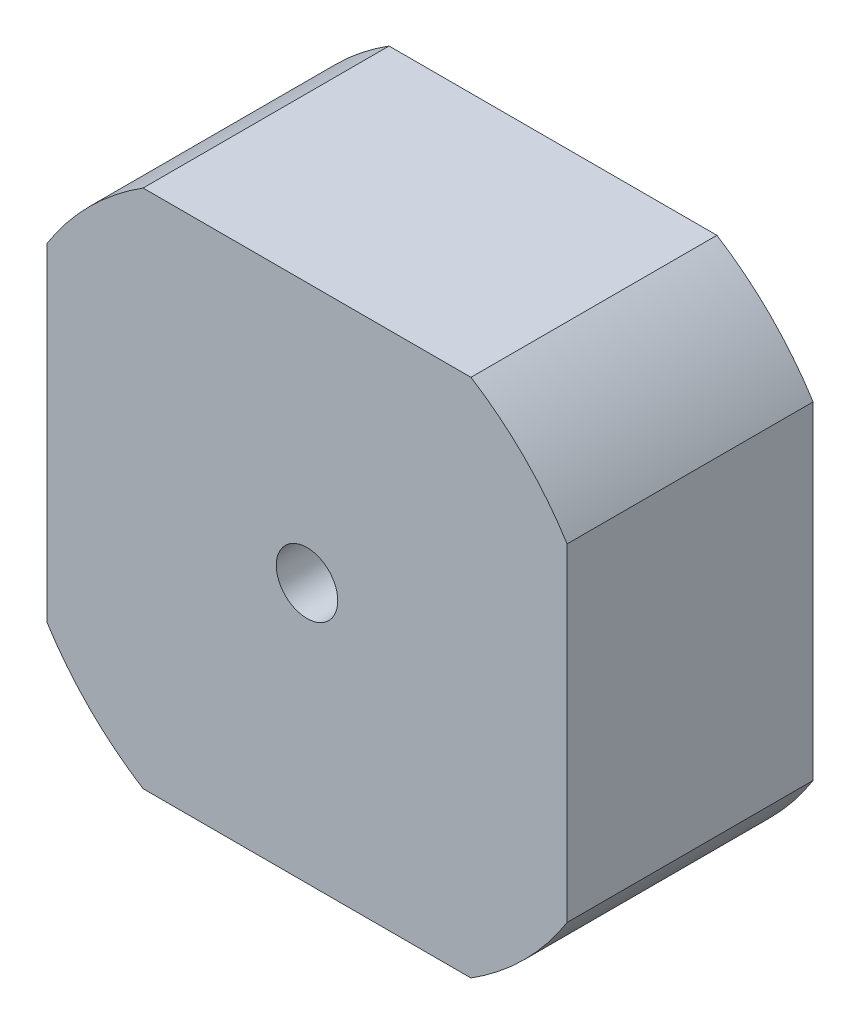
ISO-10303-21;
HEADER;
FILE_DESCRIPTION(('STEP AP214'),'2;1');
FILE_NAME('part.step','',(''),(''),'','','');
FILE_SCHEMA(('AUTOMOTIVE_DESIGN { 1 0 10303 214 1 1 1 1 }'));
ENDSEC;
DATA;
#1=APPLICATION_CONTEXT('core data for automotive mechanical design processes');
#2=APPLICATION_PROTOCOL_DEFINITION('international standard','automotive_design',2000,#1);
#3=PRODUCT_CONTEXT('',#1,'mechanical');
#4=PRODUCT('Part','Part','',(#3));
#5=PRODUCT_RELATED_PRODUCT_CATEGORY('part','',(#4));
#6=PRODUCT_DEFINITION_FORMATION('','',#4);
#7=PRODUCT_DEFINITION_CONTEXT('part definition',#1,'design');
#8=PRODUCT_DEFINITION('design','',#6,#7);
#9=PRODUCT_DEFINITION_SHAPE('','',#8);
#10=(LENGTH_UNIT() NAMED_UNIT(*) SI_UNIT(.MILLI.,.METRE.));
#11=(NAMED_UNIT(*) PLANE_ANGLE_UNIT() SI_UNIT($,.RADIAN.));
#12=(NAMED_UNIT(*) SI_UNIT($,.STERADIAN.) SOLID_ANGLE_UNIT());
#13=UNCERTAINTY_MEASURE_WITH_UNIT(LENGTH_MEASURE(1.E-05),#10,'distance_accuracy_value','');
#14=(GEOMETRIC_REPRESENTATION_CONTEXT(3) GLOBAL_UNCERTAINTY_ASSIGNED_CONTEXT((#13)) GLOBAL_UNIT_ASSIGNED_CONTEXT((#10,
#11,#12)) REPRESENTATION_CONTEXT('',''));
#15=CARTESIAN_POINT('',(0.,0.,0.));
#16=DIRECTION('',(0.,0.,1.));
#17=DIRECTION('',(1.,0.,0.));
#18=AXIS2_PLACEMENT_3D('',#15,#16,#17);
#19=CARTESIAN_POINT('',(0.,0.,20.));
#20=DIRECTION('',(0.,0.,-1.));
#21=DIRECTION('',(-1.,0.,0.));
#22=AXIS2_PLACEMENT_3D('',#19,#20,#21);
#23=CYLINDRICAL_SURFACE('',#22,25.);
#24=CARTESIAN_POINT('',(0.,0.,0.));
#25=DIRECTION('',(0.,0.,1.));
#26=DIRECTION('',(1.,0.,0.));
#27=AXIS2_PLACEMENT_3D('',#24,#25,#26);
#28=CIRCLE('',#27,25.);
#29=CARTESIAN_POINT('',(-13.3295723862396,21.15,0.));
#30=VERTEX_POINT('',#29);
#31=CARTESIAN_POINT('',(-21.15,13.3295723862396,0.));
#32=VERTEX_POINT('',#31);
#33=EDGE_CURVE('E136',#30,#32,#28,.T.);
#34=ORIENTED_EDGE('',*,*,#33,.T.);
#35=DIRECTION('',(0.,0.,-1.));
#36=VECTOR('',#35,1.);
#37=CARTESIAN_POINT('',(-21.15,13.3295723862396,20.));
#38=LINE('',#37,#36);
#39=CARTESIAN_POINT('',(-21.15,13.3295723862396,20.));
#40=VERTEX_POINT('',#39);
#41=EDGE_CURVE('E11',#40,#32,#38,.T.);
#42=ORIENTED_EDGE('',*,*,#41,.F.);
#43=CARTESIAN_POINT('',(0.,0.,20.));
#44=DIRECTION('',(0.,0.,1.));
#45=DIRECTION('',(1.,0.,0.));
#46=AXIS2_PLACEMENT_3D('',#43,#44,#45);
#47=CIRCLE('',#46,25.);
#48=CARTESIAN_POINT('',(-13.3295723862396,21.15,20.));
#49=VERTEX_POINT('',#48);
#50=EDGE_CURVE('E151',#49,#40,#47,.T.);
#51=ORIENTED_EDGE('',*,*,#50,.F.);
#52=DIRECTION('',(0.,0.,-1.));
#53=VECTOR('',#52,1.);
#54=CARTESIAN_POINT('',(-13.3295723862396,21.15,20.));
#55=LINE('',#54,#53);
#56=EDGE_CURVE('E132',#49,#30,#55,.T.);
#57=ORIENTED_EDGE('',*,*,#56,.T.);
#58=EDGE_LOOP('',(#34,#42,#51,#57));
#59=FACE_BOUND('',#58,.T.);
#60=ADVANCED_FACE('F40',(#59),#23,.T.);
#61=CARTESIAN_POINT('',(-21.15,-13.3295723862395,20.));
#62=DIRECTION('',(1.,0.,0.));
#63=DIRECTION('',(0.,0.,-1.));
#64=AXIS2_PLACEMENT_3D('',#61,#62,#63);
#65=PLANE('',#64);
#66=DIRECTION('',(0.,-1.,0.));
#67=VECTOR('',#66,1.);
#68=CARTESIAN_POINT('',(-21.15,-13.3295723862395,0.));
#69=LINE('',#68,#67);
#70=CARTESIAN_POINT('',(-21.15,-13.3295723862395,0.));
#71=VERTEX_POINT('',#70);
#72=EDGE_CURVE('E139',#32,#71,#69,.T.);
#73=ORIENTED_EDGE('',*,*,#72,.T.);
#74=DIRECTION('',(0.,0.,-1.));
#75=VECTOR('',#74,1.);
#76=CARTESIAN_POINT('',(-21.15,-13.3295723862395,20.));
#77=LINE('',#76,#75);
#78=CARTESIAN_POINT('',(-21.15,-13.3295723862395,20.));
#79=VERTEX_POINT('',#78);
#80=EDGE_CURVE('E48',#79,#71,#77,.T.);
#81=ORIENTED_EDGE('',*,*,#80,.F.);
#82=DIRECTION('',(0.,-1.,0.));
#83=VECTOR('',#82,1.);
#84=CARTESIAN_POINT('',(-21.15,-13.3295723862395,20.));
#85=LINE('',#84,#83);
#86=EDGE_CURVE('E99',#40,#79,#85,.T.);
#87=ORIENTED_EDGE('',*,*,#86,.F.);
#88=ORIENTED_EDGE('',*,*,#41,.T.);
#89=EDGE_LOOP('',(#73,#81,#87,#88));
#90=FACE_BOUND('',#89,.T.);
#91=ADVANCED_FACE('F207',(#90),#65,.F.);
#92=CARTESIAN_POINT('',(0.,0.,20.));
#93=DIRECTION('',(0.,0.,-1.));
#94=DIRECTION('',(-1.,0.,0.));
#95=AXIS2_PLACEMENT_3D('',#92,#93,#94);
#96=CYLINDRICAL_SURFACE('',#95,25.);
#97=CARTESIAN_POINT('',(0.,0.,0.));
#98=DIRECTION('',(0.,0.,1.));
#99=DIRECTION('',(1.,0.,0.));
#100=AXIS2_PLACEMENT_3D('',#97,#98,#99);
#101=CIRCLE('',#100,25.);
#102=CARTESIAN_POINT('',(-13.3295723862396,-21.15,0.));
#103=VERTEX_POINT('',#102);
#104=EDGE_CURVE('E142',#71,#103,#101,.T.);
#105=ORIENTED_EDGE('',*,*,#104,.T.);
#106=DIRECTION('',(0.,0.,-1.));
#107=VECTOR('',#106,1.);
#108=CARTESIAN_POINT('',(-13.3295723862396,-21.15,20.));
#109=LINE('',#108,#107);
#110=CARTESIAN_POINT('',(-13.3295723862396,-21.15,20.));
#111=VERTEX_POINT('',#110);
#112=EDGE_CURVE('E158',#111,#103,#109,.T.);
#113=ORIENTED_EDGE('',*,*,#112,.F.);
#114=CARTESIAN_POINT('',(0.,0.,20.));
#115=DIRECTION('',(0.,0.,1.));
#116=DIRECTION('',(1.,0.,0.));
#117=AXIS2_PLACEMENT_3D('',#114,#115,#116);
#118=CIRCLE('',#117,25.);
#119=EDGE_CURVE('E166',#79,#111,#118,.T.);
#120=ORIENTED_EDGE('',*,*,#119,.F.);
#121=ORIENTED_EDGE('',*,*,#80,.T.);
#122=EDGE_LOOP('',(#105,#113,#120,#121));
#123=FACE_BOUND('',#122,.T.);
#124=ADVANCED_FACE('F164',(#123),#96,.T.);
#125=CARTESIAN_POINT('',(-13.3295723862396,-21.15,20.));
#126=DIRECTION('',(0.,1.,0.));
#127=DIRECTION('',(0.,0.,1.));
#128=AXIS2_PLACEMENT_3D('',#125,#126,#127);
#129=PLANE('',#128);
#130=DIRECTION('',(1.,0.,0.));
#131=VECTOR('',#130,1.);
#132=CARTESIAN_POINT('',(-13.3295723862396,-21.15,0.));
#133=LINE('',#132,#131);
#134=CARTESIAN_POINT('',(13.3295723862396,-21.15,0.));
#135=VERTEX_POINT('',#134);
#136=EDGE_CURVE('E144',#103,#135,#133,.T.);
#137=ORIENTED_EDGE('',*,*,#136,.T.);
#138=DIRECTION('',(0.,0.,-1.));
#139=VECTOR('',#138,1.);
#140=CARTESIAN_POINT('',(13.3295723862396,-21.15,20.));
#141=LINE('',#140,#139);
#142=CARTESIAN_POINT('',(13.3295723862396,-21.15,20.));
#143=VERTEX_POINT('',#142);
#144=EDGE_CURVE('E155',#143,#135,#141,.T.);
#145=ORIENTED_EDGE('',*,*,#144,.F.);
#146=DIRECTION('',(1.,0.,0.));
#147=VECTOR('',#146,1.);
#148=CARTESIAN_POINT('',(-13.3295723862396,-21.15,20.));
#149=LINE('',#148,#147);
#150=EDGE_CURVE('E178',#111,#143,#149,.T.);
#151=ORIENTED_EDGE('',*,*,#150,.F.);
#152=ORIENTED_EDGE('',*,*,#112,.T.);
#153=EDGE_LOOP('',(#137,#145,#151,#152));
#154=FACE_BOUND('',#153,.T.);
#155=ADVANCED_FACE('F174',(#154),#129,.F.);
#156=CARTESIAN_POINT('',(0.,0.,20.));
#157=DIRECTION('',(0.,0.,-1.));
#158=DIRECTION('',(-1.,0.,0.));
#159=AXIS2_PLACEMENT_3D('',#156,#157,#158);
#160=CYLINDRICAL_SURFACE('',#159,25.);
#161=CARTESIAN_POINT('',(0.,0.,0.));
#162=DIRECTION('',(0.,0.,1.));
#163=DIRECTION('',(1.,0.,0.));
#164=AXIS2_PLACEMENT_3D('',#161,#162,#163);
#165=CIRCLE('',#164,25.);
#166=CARTESIAN_POINT('',(21.15,-13.3295723862396,0.));
#167=VERTEX_POINT('',#166);
#168=EDGE_CURVE('E146',#135,#167,#165,.T.);
#169=ORIENTED_EDGE('',*,*,#168,.T.);
#170=DIRECTION('',(0.,0.,-1.));
#171=VECTOR('',#170,1.);
#172=CARTESIAN_POINT('',(21.15,-13.3295723862396,20.));
#173=LINE('',#172,#171);
#174=CARTESIAN_POINT('',(21.15,-13.3295723862396,20.));
#175=VERTEX_POINT('',#174);
#176=EDGE_CURVE('E127',#175,#167,#173,.T.);
#177=ORIENTED_EDGE('',*,*,#176,.F.);
#178=CARTESIAN_POINT('',(0.,0.,20.));
#179=DIRECTION('',(0.,0.,1.));
#180=DIRECTION('',(1.,0.,0.));
#181=AXIS2_PLACEMENT_3D('',#178,#179,#180);
#182=CIRCLE('',#181,25.);
#183=EDGE_CURVE('E118',#143,#175,#182,.T.);
#184=ORIENTED_EDGE('',*,*,#183,.F.);
#185=ORIENTED_EDGE('',*,*,#144,.T.);
#186=EDGE_LOOP('',(#169,#177,#184,#185));
#187=FACE_BOUND('',#186,.T.);
#188=ADVANCED_FACE('F177',(#187),#160,.T.);
#189=CARTESIAN_POINT('',(21.15,-13.3295723862396,20.));
#190=DIRECTION('',(-1.,0.,0.));
#191=DIRECTION('',(0.,0.,1.));
#192=AXIS2_PLACEMENT_3D('',#189,#190,#191);
#193=PLANE('',#192);
#194=DIRECTION('',(0.,1.,0.));
#195=VECTOR('',#194,1.);
#196=CARTESIAN_POINT('',(21.15,-13.3295723862396,0.));
#197=LINE('',#196,#195);
#198=CARTESIAN_POINT('',(21.15,13.3295723862396,0.));
#199=VERTEX_POINT('',#198);
#200=EDGE_CURVE('E126',#167,#199,#197,.T.);
#201=ORIENTED_EDGE('',*,*,#200,.T.);
#202=DIRECTION('',(0.,0.,-1.));
#203=VECTOR('',#202,1.);
#204=CARTESIAN_POINT('',(21.15,13.3295723862396,20.));
#205=LINE('',#204,#203);
#206=CARTESIAN_POINT('',(21.15,13.3295723862396,20.));
#207=VERTEX_POINT('',#206);
#208=EDGE_CURVE('E123',#207,#199,#205,.T.);
#209=ORIENTED_EDGE('',*,*,#208,.F.);
#210=DIRECTION('',(0.,1.,0.));
#211=VECTOR('',#210,1.);
#212=CARTESIAN_POINT('',(21.15,-13.3295723862396,20.));
#213=LINE('',#212,#211);
#214=EDGE_CURVE('E112',#175,#207,#213,.T.);
#215=ORIENTED_EDGE('',*,*,#214,.F.);
#216=ORIENTED_EDGE('',*,*,#176,.T.);
#217=EDGE_LOOP('',(#201,#209,#215,#216));
#218=FACE_BOUND('',#217,.T.);
#219=ADVANCED_FACE('F124',(#218),#193,.F.);
#220=CARTESIAN_POINT('',(0.,0.,20.));
#221=DIRECTION('',(0.,0.,-1.));
#222=DIRECTION('',(-1.,0.,0.));
#223=AXIS2_PLACEMENT_3D('',#220,#221,#222);
#224=CYLINDRICAL_SURFACE('',#223,25.);
#225=CARTESIAN_POINT('',(0.,0.,0.));
#226=DIRECTION('',(0.,0.,1.));
#227=DIRECTION('',(1.,0.,0.));
#228=AXIS2_PLACEMENT_3D('',#225,#226,#227);
#229=CIRCLE('',#228,25.);
#230=CARTESIAN_POINT('',(13.3295723862396,21.15,0.));
#231=VERTEX_POINT('',#230);
#232=EDGE_CURVE('E85',#199,#231,#229,.T.);
#233=ORIENTED_EDGE('',*,*,#232,.T.);
#234=DIRECTION('',(0.,0.,-1.));
#235=VECTOR('',#234,1.);
#236=CARTESIAN_POINT('',(13.3295723862396,21.15,20.));
#237=LINE('',#236,#235);
#238=CARTESIAN_POINT('',(13.3295723862396,21.15,20.));
#239=VERTEX_POINT('',#238);
#240=EDGE_CURVE('E128',#239,#231,#237,.T.);
#241=ORIENTED_EDGE('',*,*,#240,.F.);
#242=CARTESIAN_POINT('',(0.,0.,20.));
#243=DIRECTION('',(0.,0.,1.));
#244=DIRECTION('',(1.,0.,0.));
#245=AXIS2_PLACEMENT_3D('',#242,#243,#244);
#246=CIRCLE('',#245,25.);
#247=EDGE_CURVE('E116',#207,#239,#246,.T.);
#248=ORIENTED_EDGE('',*,*,#247,.F.);
#249=ORIENTED_EDGE('',*,*,#208,.T.);
#250=EDGE_LOOP('',(#233,#241,#248,#249));
#251=FACE_BOUND('',#250,.T.);
#252=ADVANCED_FACE('F130',(#251),#224,.T.);
#253=CARTESIAN_POINT('',(-13.3295723862396,21.15,20.));
#254=DIRECTION('',(0.,-1.,0.));
#255=DIRECTION('',(0.,0.,-1.));
#256=AXIS2_PLACEMENT_3D('',#253,#254,#255);
#257=PLANE('',#256);
#258=DIRECTION('',(-1.,0.,0.));
#259=VECTOR('',#258,1.);
#260=CARTESIAN_POINT('',(-13.3295723862396,21.15,0.));
#261=LINE('',#260,#259);
#262=EDGE_CURVE('E91',#231,#30,#261,.T.);
#263=ORIENTED_EDGE('',*,*,#262,.T.);
#264=ORIENTED_EDGE('',*,*,#56,.F.);
#265=DIRECTION('',(-1.,0.,0.));
#266=VECTOR('',#265,1.);
#267=CARTESIAN_POINT('',(-13.3295723862396,21.15,20.));
#268=LINE('',#267,#266);
#269=EDGE_CURVE('E56',#239,#49,#268,.T.);
#270=ORIENTED_EDGE('',*,*,#269,.F.);
#271=ORIENTED_EDGE('',*,*,#240,.T.);
#272=EDGE_LOOP('',(#263,#264,#270,#271));
#273=FACE_BOUND('',#272,.T.);
#274=ADVANCED_FACE('F198',(#273),#257,.F.);
#275=CARTESIAN_POINT('',(0.,0.,20.));
#276=DIRECTION('',(0.,0.,1.));
#277=DIRECTION('',(1.,0.,0.));
#278=AXIS2_PLACEMENT_3D('',#275,#276,#277);
#279=PLANE('',#278);
#280=CARTESIAN_POINT('',(0.,0.,20.));
#281=DIRECTION('',(0.,0.,1.));
#282=DIRECTION('',(1.,0.,0.));
#283=AXIS2_PLACEMENT_3D('',#280,#281,#282);
#284=CIRCLE('',#283,2.5);
#285=CARTESIAN_POINT('',(2.5,0.,20.));
#286=VERTEX_POINT('',#285);
#287=EDGE_CURVE('E184',#286,#286,#284,.T.);
#288=ORIENTED_EDGE('',*,*,#287,.F.);
#289=EDGE_LOOP('',(#288));
#290=FACE_BOUND('',#289,.T.);
#291=ORIENTED_EDGE('',*,*,#50,.T.);
#292=ORIENTED_EDGE('',*,*,#86,.T.);
#293=ORIENTED_EDGE('',*,*,#119,.T.);
#294=ORIENTED_EDGE('',*,*,#150,.T.);
#295=ORIENTED_EDGE('',*,*,#183,.T.);
#296=ORIENTED_EDGE('',*,*,#214,.T.);
#297=ORIENTED_EDGE('',*,*,#247,.T.);
#298=ORIENTED_EDGE('',*,*,#269,.T.);
#299=EDGE_LOOP('',(#291,#292,#293,#294,#295,#296,#297,#298));
#300=FACE_BOUND('',#299,.T.);
#301=ADVANCED_FACE('F114',(#290,#300),#279,.T.);
#302=CARTESIAN_POINT('',(0.,0.,0.));
#303=DIRECTION('',(0.,0.,1.));
#304=DIRECTION('',(1.,0.,0.));
#305=AXIS2_PLACEMENT_3D('',#302,#303,#304);
#306=PLANE('',#305);
#307=CARTESIAN_POINT('',(0.,0.,0.));
#308=DIRECTION('',(0.,0.,1.));
#309=DIRECTION('',(1.,0.,0.));
#310=AXIS2_PLACEMENT_3D('',#307,#308,#309);
#311=CIRCLE('',#310,2.5);
#312=CARTESIAN_POINT('',(2.5,0.,0.));
#313=VERTEX_POINT('',#312);
#314=EDGE_CURVE('E140',#313,#313,#311,.T.);
#315=ORIENTED_EDGE('',*,*,#314,.T.);
#316=EDGE_LOOP('',(#315));
#317=FACE_BOUND('',#316,.T.);
#318=ORIENTED_EDGE('',*,*,#33,.F.);
#319=ORIENTED_EDGE('',*,*,#262,.F.);
#320=ORIENTED_EDGE('',*,*,#232,.F.);
#321=ORIENTED_EDGE('',*,*,#200,.F.);
#322=ORIENTED_EDGE('',*,*,#168,.F.);
#323=ORIENTED_EDGE('',*,*,#136,.F.);
#324=ORIENTED_EDGE('',*,*,#104,.F.);
#325=ORIENTED_EDGE('',*,*,#72,.F.);
#326=EDGE_LOOP('',(#318,#319,#320,#321,#322,#323,#324,#325));
#327=FACE_BOUND('',#326,.T.);
#328=ADVANCED_FACE('F170',(#317,#327),#306,.F.);
#329=CARTESIAN_POINT('',(0.,0.,0.));
#330=DIRECTION('',(0.,0.,1.));
#331=DIRECTION('',(1.,0.,0.));
#332=AXIS2_PLACEMENT_3D('',#329,#330,#331);
#333=CYLINDRICAL_SURFACE('',#332,2.5);
#334=ORIENTED_EDGE('',*,*,#314,.F.);
#335=EDGE_LOOP('',(#334));
#336=FACE_BOUND('',#335,.T.);
#337=ORIENTED_EDGE('',*,*,#287,.T.);
#338=EDGE_LOOP('',(#337));
#339=FACE_BOUND('',#338,.T.);
#340=ADVANCED_FACE('F191',(#336,#339),#333,.F.);
#341=CLOSED_SHELL('',(#60,#91,#124,#155,#188,#219,#252,#274,#301,#328,#340));
#342=MANIFOLD_SOLID_BREP('B2',#341);
#343=ADVANCED_BREP_SHAPE_REPRESENTATION('',(#18,#342),#14);
#344=SHAPE_DEFINITION_REPRESENTATION(#9,#343);
ENDSEC;
END-ISO-10303-21;
